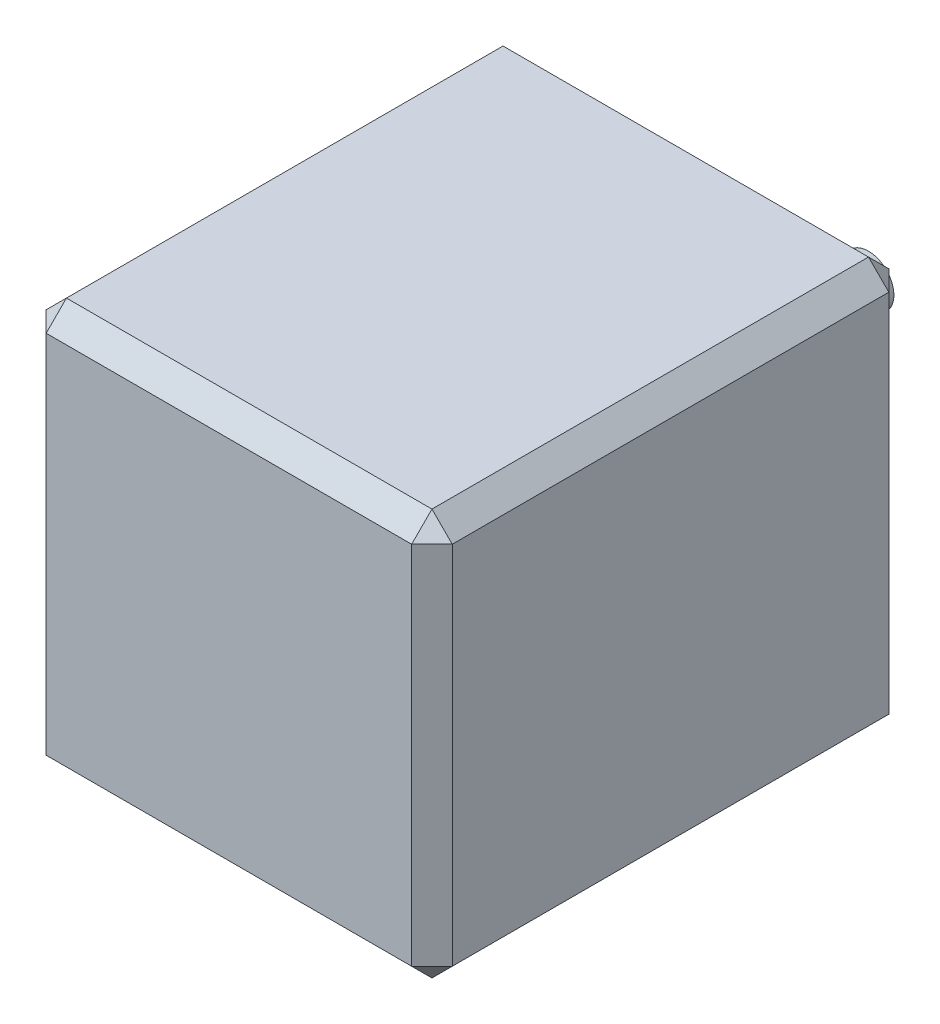
ISO-10303-21;
HEADER;
FILE_DESCRIPTION(('STEP AP214'),'2;1');
FILE_NAME('part.step','',(''),(''),'','','');
FILE_SCHEMA(('AUTOMOTIVE_DESIGN { 1 0 10303 214 1 1 1 1 }'));
ENDSEC;
DATA;
#1=APPLICATION_CONTEXT('core data for automotive mechanical design processes');
#2=APPLICATION_PROTOCOL_DEFINITION('international standard','automotive_design',2000,#1);
#3=PRODUCT_CONTEXT('',#1,'mechanical');
#4=PRODUCT('Part','Part','',(#3));
#5=PRODUCT_RELATED_PRODUCT_CATEGORY('part','',(#4));
#6=PRODUCT_DEFINITION_FORMATION('','',#4);
#7=PRODUCT_DEFINITION_CONTEXT('part definition',#1,'design');
#8=PRODUCT_DEFINITION('design','',#6,#7);
#9=PRODUCT_DEFINITION_SHAPE('','',#8);
#10=(LENGTH_UNIT() NAMED_UNIT(*) SI_UNIT(.MILLI.,.METRE.));
#11=(NAMED_UNIT(*) PLANE_ANGLE_UNIT() SI_UNIT($,.RADIAN.));
#12=(NAMED_UNIT(*) SI_UNIT($,.STERADIAN.) SOLID_ANGLE_UNIT());
#13=UNCERTAINTY_MEASURE_WITH_UNIT(LENGTH_MEASURE(1.E-05),#10,'distance_accuracy_value','');
#14=(GEOMETRIC_REPRESENTATION_CONTEXT(3) GLOBAL_UNCERTAINTY_ASSIGNED_CONTEXT((#13)) GLOBAL_UNIT_ASSIGNED_CONTEXT((#10,
#11,#12)) REPRESENTATION_CONTEXT('',''));
#15=CARTESIAN_POINT('',(0.,0.,0.));
#16=DIRECTION('',(0.,0.,1.));
#17=DIRECTION('',(1.,0.,0.));
#18=AXIS2_PLACEMENT_3D('',#15,#16,#17);
#19=CARTESIAN_POINT('',(20.,20.,23.5));
#20=DIRECTION('',(-1.,0.,0.));
#21=DIRECTION('',(0.,-1.,0.));
#22=AXIS2_PLACEMENT_3D('',#19,#20,#21);
#23=PLANE('',#22);
#24=DIRECTION('',(0.,-1.,0.));
#25=VECTOR('',#24,1.);
#26=CARTESIAN_POINT('',(20.,-20.,21.5));
#27=LINE('',#26,#25);
#28=CARTESIAN_POINT('',(20.,18.,21.5));
#29=VERTEX_POINT('',#28);
#30=CARTESIAN_POINT('',(20.,-18.,21.5));
#31=VERTEX_POINT('',#30);
#32=EDGE_CURVE('E199',#29,#31,#27,.T.);
#33=ORIENTED_EDGE('',*,*,#32,.T.);
#34=DIRECTION('',(0.,0.,-1.));
#35=VECTOR('',#34,1.);
#36=CARTESIAN_POINT('',(20.,-18.,23.5));
#37=LINE('',#36,#35);
#38=CARTESIAN_POINT('',(20.,-18.,-21.5));
#39=VERTEX_POINT('',#38);
#40=EDGE_CURVE('E201',#31,#39,#37,.T.);
#41=ORIENTED_EDGE('',*,*,#40,.T.);
#42=DIRECTION('',(0.,1.,0.));
#43=VECTOR('',#42,1.);
#44=CARTESIAN_POINT('',(20.,20.,-21.5));
#45=LINE('',#44,#43);
#46=CARTESIAN_POINT('',(20.,18.,-21.5));
#47=VERTEX_POINT('',#46);
#48=EDGE_CURVE('E197',#39,#47,#45,.T.);
#49=ORIENTED_EDGE('',*,*,#48,.T.);
#50=DIRECTION('',(0.,0.,1.));
#51=VECTOR('',#50,1.);
#52=CARTESIAN_POINT('',(20.,18.,23.5));
#53=LINE('',#52,#51);
#54=EDGE_CURVE('E195',#47,#29,#53,.T.);
#55=ORIENTED_EDGE('',*,*,#54,.T.);
#56=EDGE_LOOP('',(#33,#41,#49,#55));
#57=FACE_BOUND('',#56,.T.);
#58=ADVANCED_FACE('F39',(#57),#23,.F.);
#59=CARTESIAN_POINT('',(-20.,20.,23.5));
#60=DIRECTION('',(0.,-1.,0.));
#61=DIRECTION('',(0.,0.,-1.));
#62=AXIS2_PLACEMENT_3D('',#59,#60,#61);
#63=PLANE('',#62);
#64=DIRECTION('',(1.,0.,0.));
#65=VECTOR('',#64,1.);
#66=CARTESIAN_POINT('',(20.,20.,21.5));
#67=LINE('',#66,#65);
#68=CARTESIAN_POINT('',(-18.,20.,21.5));
#69=VERTEX_POINT('',#68);
#70=CARTESIAN_POINT('',(18.,20.,21.5));
#71=VERTEX_POINT('',#70);
#72=EDGE_CURVE('E56',#69,#71,#67,.T.);
#73=ORIENTED_EDGE('',*,*,#72,.T.);
#74=DIRECTION('',(0.,0.,-1.));
#75=VECTOR('',#74,1.);
#76=CARTESIAN_POINT('',(18.,20.,23.5));
#77=LINE('',#76,#75);
#78=CARTESIAN_POINT('',(18.,20.,-21.5));
#79=VERTEX_POINT('',#78);
#80=EDGE_CURVE('E49',#71,#79,#77,.T.);
#81=ORIENTED_EDGE('',*,*,#80,.T.);
#82=DIRECTION('',(-1.,0.,0.));
#83=VECTOR('',#82,1.);
#84=CARTESIAN_POINT('',(-20.,20.,-21.5));
#85=LINE('',#84,#83);
#86=CARTESIAN_POINT('',(-18.,20.,-21.5));
#87=VERTEX_POINT('',#86);
#88=EDGE_CURVE('E204',#79,#87,#85,.T.);
#89=ORIENTED_EDGE('',*,*,#88,.T.);
#90=DIRECTION('',(0.,0.,1.));
#91=VECTOR('',#90,1.);
#92=CARTESIAN_POINT('',(-18.,20.,23.5));
#93=LINE('',#92,#91);
#94=EDGE_CURVE('E61',#87,#69,#93,.T.);
#95=ORIENTED_EDGE('',*,*,#94,.T.);
#96=EDGE_LOOP('',(#73,#81,#89,#95));
#97=FACE_BOUND('',#96,.T.);
#98=ADVANCED_FACE('F309',(#97),#63,.F.);
#99=CARTESIAN_POINT('',(-20.,20.,23.5));
#100=DIRECTION('',(1.,0.,0.));
#101=DIRECTION('',(0.,1.,0.));
#102=AXIS2_PLACEMENT_3D('',#99,#100,#101);
#103=PLANE('',#102);
#104=DIRECTION('',(0.,-1.,0.));
#105=VECTOR('',#104,1.);
#106=CARTESIAN_POINT('',(-20.,20.,-21.5));
#107=LINE('',#106,#105);
#108=CARTESIAN_POINT('',(-20.,18.,-21.5));
#109=VERTEX_POINT('',#108);
#110=CARTESIAN_POINT('',(-20.,-18.,-21.5));
#111=VERTEX_POINT('',#110);
#112=EDGE_CURVE('E181',#109,#111,#107,.T.);
#113=ORIENTED_EDGE('',*,*,#112,.T.);
#114=DIRECTION('',(0.,0.,1.));
#115=VECTOR('',#114,1.);
#116=CARTESIAN_POINT('',(-20.,-18.,23.5));
#117=LINE('',#116,#115);
#118=CARTESIAN_POINT('',(-20.,-18.,21.5));
#119=VERTEX_POINT('',#118);
#120=EDGE_CURVE('E183',#111,#119,#117,.T.);
#121=ORIENTED_EDGE('',*,*,#120,.T.);
#122=DIRECTION('',(0.,1.,0.));
#123=VECTOR('',#122,1.);
#124=CARTESIAN_POINT('',(-20.,20.,21.5));
#125=LINE('',#124,#123);
#126=CARTESIAN_POINT('',(-20.,18.,21.5));
#127=VERTEX_POINT('',#126);
#128=EDGE_CURVE('E179',#119,#127,#125,.T.);
#129=ORIENTED_EDGE('',*,*,#128,.T.);
#130=DIRECTION('',(0.,0.,-1.));
#131=VECTOR('',#130,1.);
#132=CARTESIAN_POINT('',(-20.,18.,23.5));
#133=LINE('',#132,#131);
#134=EDGE_CURVE('E177',#127,#109,#133,.T.);
#135=ORIENTED_EDGE('',*,*,#134,.T.);
#136=EDGE_LOOP('',(#113,#121,#129,#135));
#137=FACE_BOUND('',#136,.T.);
#138=ADVANCED_FACE('F278',(#137),#103,.F.);
#139=CARTESIAN_POINT('',(-20.,-20.,23.5));
#140=DIRECTION('',(0.,1.,0.));
#141=DIRECTION('',(0.,0.,1.));
#142=AXIS2_PLACEMENT_3D('',#139,#140,#141);
#143=PLANE('',#142);
#144=DIRECTION('',(0.,0.,-1.));
#145=VECTOR('',#144,1.);
#146=CARTESIAN_POINT('',(-18.,-20.,23.5));
#147=LINE('',#146,#145);
#148=CARTESIAN_POINT('',(-18.,-20.,21.5));
#149=VERTEX_POINT('',#148);
#150=CARTESIAN_POINT('',(-18.,-20.,-21.5));
#151=VERTEX_POINT('',#150);
#152=EDGE_CURVE('E164',#149,#151,#147,.T.);
#153=ORIENTED_EDGE('',*,*,#152,.T.);
#154=DIRECTION('',(1.,0.,0.));
#155=VECTOR('',#154,1.);
#156=CARTESIAN_POINT('',(-20.,-20.,-21.5));
#157=LINE('',#156,#155);
#158=CARTESIAN_POINT('',(18.,-20.,-21.5));
#159=VERTEX_POINT('',#158);
#160=EDGE_CURVE('E134',#151,#159,#157,.T.);
#161=ORIENTED_EDGE('',*,*,#160,.T.);
#162=DIRECTION('',(0.,0.,1.));
#163=VECTOR('',#162,1.);
#164=CARTESIAN_POINT('',(18.,-20.,23.5));
#165=LINE('',#164,#163);
#166=CARTESIAN_POINT('',(18.,-20.,21.5));
#167=VERTEX_POINT('',#166);
#168=EDGE_CURVE('E153',#159,#167,#165,.T.);
#169=ORIENTED_EDGE('',*,*,#168,.T.);
#170=DIRECTION('',(-1.,0.,0.));
#171=VECTOR('',#170,1.);
#172=CARTESIAN_POINT('',(-20.,-20.,21.5));
#173=LINE('',#172,#171);
#174=EDGE_CURVE('E159',#167,#149,#173,.T.);
#175=ORIENTED_EDGE('',*,*,#174,.T.);
#176=EDGE_LOOP('',(#153,#161,#169,#175));
#177=FACE_BOUND('',#176,.T.);
#178=ADVANCED_FACE('F162',(#177),#143,.F.);
#179=CARTESIAN_POINT('',(0.,0.,23.5));
#180=DIRECTION('',(0.,0.,1.));
#181=DIRECTION('',(1.,0.,0.));
#182=AXIS2_PLACEMENT_3D('',#179,#180,#181);
#183=PLANE('',#182);
#184=DIRECTION('',(0.,-1.,0.));
#185=VECTOR('',#184,1.);
#186=CARTESIAN_POINT('',(-18.,-20.,23.5));
#187=LINE('',#186,#185);
#188=CARTESIAN_POINT('',(-18.,18.,23.5));
#189=VERTEX_POINT('',#188);
#190=CARTESIAN_POINT('',(-18.,-18.,23.5));
#191=VERTEX_POINT('',#190);
#192=EDGE_CURVE('E190',#189,#191,#187,.T.);
#193=ORIENTED_EDGE('',*,*,#192,.T.);
#194=DIRECTION('',(1.,0.,0.));
#195=VECTOR('',#194,1.);
#196=CARTESIAN_POINT('',(20.,-18.,23.5));
#197=LINE('',#196,#195);
#198=CARTESIAN_POINT('',(18.,-18.,23.5));
#199=VERTEX_POINT('',#198);
#200=EDGE_CURVE('E192',#191,#199,#197,.T.);
#201=ORIENTED_EDGE('',*,*,#200,.T.);
#202=DIRECTION('',(0.,1.,0.));
#203=VECTOR('',#202,1.);
#204=CARTESIAN_POINT('',(18.,20.,23.5));
#205=LINE('',#204,#203);
#206=CARTESIAN_POINT('',(18.,18.,23.5));
#207=VERTEX_POINT('',#206);
#208=EDGE_CURVE('E188',#199,#207,#205,.T.);
#209=ORIENTED_EDGE('',*,*,#208,.T.);
#210=DIRECTION('',(-1.,0.,0.));
#211=VECTOR('',#210,1.);
#212=CARTESIAN_POINT('',(-20.,18.,23.5));
#213=LINE('',#212,#211);
#214=EDGE_CURVE('E186',#207,#189,#213,.T.);
#215=ORIENTED_EDGE('',*,*,#214,.T.);
#216=EDGE_LOOP('',(#193,#201,#209,#215));
#217=FACE_BOUND('',#216,.T.);
#218=ADVANCED_FACE('F287',(#217),#183,.T.);
#219=CARTESIAN_POINT('',(0.,0.,-23.5));
#220=DIRECTION('',(0.,0.,1.));
#221=DIRECTION('',(1.,0.,0.));
#222=AXIS2_PLACEMENT_3D('',#219,#220,#221);
#223=PLANE('',#222);
#224=CARTESIAN_POINT('',(0.,0.,-23.5));
#225=DIRECTION('',(0.,0.,1.));
#226=DIRECTION('',(1.,0.,0.));
#227=AXIS2_PLACEMENT_3D('',#224,#225,#226);
#228=CIRCLE('',#227,11.);
#229=CARTESIAN_POINT('',(11.,0.,-23.5));
#230=VERTEX_POINT('',#229);
#231=EDGE_CURVE('E11',#230,#230,#228,.F.);
#232=ORIENTED_EDGE('',*,*,#231,.F.);
#233=EDGE_LOOP('',(#232));
#234=FACE_BOUND('',#233,.T.);
#235=DIRECTION('',(0.,-1.,0.));
#236=VECTOR('',#235,1.);
#237=CARTESIAN_POINT('',(18.,0.,-23.5));
#238=LINE('',#237,#236);
#239=CARTESIAN_POINT('',(18.,18.,-23.5));
#240=VERTEX_POINT('',#239);
#241=CARTESIAN_POINT('',(18.,-18.,-23.5));
#242=VERTEX_POINT('',#241);
#243=EDGE_CURVE('E168',#240,#242,#238,.T.);
#244=ORIENTED_EDGE('',*,*,#243,.T.);
#245=DIRECTION('',(-1.,0.,0.));
#246=VECTOR('',#245,1.);
#247=CARTESIAN_POINT('',(0.,-18.,-23.5));
#248=LINE('',#247,#246);
#249=CARTESIAN_POINT('',(-18.,-18.,-23.5));
#250=VERTEX_POINT('',#249);
#251=EDGE_CURVE('E136',#242,#250,#248,.T.);
#252=ORIENTED_EDGE('',*,*,#251,.T.);
#253=DIRECTION('',(0.,1.,0.));
#254=VECTOR('',#253,1.);
#255=CARTESIAN_POINT('',(-18.,0.,-23.5));
#256=LINE('',#255,#254);
#257=CARTESIAN_POINT('',(-18.,18.,-23.5));
#258=VERTEX_POINT('',#257);
#259=EDGE_CURVE('E174',#250,#258,#256,.T.);
#260=ORIENTED_EDGE('',*,*,#259,.T.);
#261=DIRECTION('',(1.,0.,0.));
#262=VECTOR('',#261,1.);
#263=CARTESIAN_POINT('',(0.,18.,-23.5));
#264=LINE('',#263,#262);
#265=EDGE_CURVE('E166',#258,#240,#264,.T.);
#266=ORIENTED_EDGE('',*,*,#265,.T.);
#267=EDGE_LOOP('',(#244,#252,#260,#266));
#268=FACE_BOUND('',#267,.T.);
#269=ADVANCED_FACE('F437',(#234,#268),#223,.F.);
#270=CARTESIAN_POINT('',(0.,18.,23.5));
#271=DIRECTION('',(0.,0.707106781186546,0.707106781186549));
#272=DIRECTION('',(1.,0.,0.));
#273=AXIS2_PLACEMENT_3D('',#270,#271,#272);
#274=PLANE('',#273);
#275=DIRECTION('',(0.,0.707106781186549,-0.707106781186546));
#276=VECTOR('',#275,1.);
#277=CARTESIAN_POINT('',(-18.,19.,22.5));
#278=LINE('',#277,#276);
#279=EDGE_CURVE('E160',#189,#69,#278,.T.);
#280=ORIENTED_EDGE('',*,*,#279,.F.);
#281=ORIENTED_EDGE('',*,*,#214,.F.);
#282=DIRECTION('',(0.,-0.707106781186549,0.707106781186546));
#283=VECTOR('',#282,1.);
#284=CARTESIAN_POINT('',(18.,18.,23.5));
#285=LINE('',#284,#283);
#286=EDGE_CURVE('E259',#71,#207,#285,.T.);
#287=ORIENTED_EDGE('',*,*,#286,.F.);
#288=ORIENTED_EDGE('',*,*,#72,.F.);
#289=EDGE_LOOP('',(#280,#281,#287,#288));
#290=FACE_BOUND('',#289,.T.);
#291=ADVANCED_FACE('F42',(#290),#274,.T.);
#292=CARTESIAN_POINT('',(-20.,18.,21.5));
#293=DIRECTION('',(-0.577350269189628,0.577350269189624,0.577350269189626));
#294=DIRECTION('',(0.707106781186546,0.,0.707106781186549));
#295=AXIS2_PLACEMENT_3D('',#292,#293,#294);
#296=PLANE('',#295);
#297=DIRECTION('',(0.707106781186546,0.,0.707106781186549));
#298=VECTOR('',#297,1.);
#299=CARTESIAN_POINT('',(-20.,18.,21.5));
#300=LINE('',#299,#298);
#301=EDGE_CURVE('E253',#189,#127,#300,.F.);
#302=ORIENTED_EDGE('',*,*,#301,.F.);
#303=ORIENTED_EDGE('',*,*,#279,.T.);
#304=DIRECTION('',(0.707106781186546,0.707106781186549,0.));
#305=VECTOR('',#304,1.);
#306=CARTESIAN_POINT('',(-20.,18.,21.5));
#307=LINE('',#306,#305);
#308=EDGE_CURVE('E256',#127,#69,#307,.T.);
#309=ORIENTED_EDGE('',*,*,#308,.F.);
#310=EDGE_LOOP('',(#302,#303,#309));
#311=FACE_BOUND('',#310,.T.);
#312=ADVANCED_FACE('F267',(#311),#296,.T.);
#313=CARTESIAN_POINT('',(18.,18.,23.5));
#314=DIRECTION('',(0.577350269189628,0.577350269189624,0.577350269189626));
#315=DIRECTION('',(0.707106781186546,0.,-0.707106781186549));
#316=AXIS2_PLACEMENT_3D('',#313,#314,#315);
#317=PLANE('',#316);
#318=DIRECTION('',(0.707106781186546,-0.707106781186549,0.));
#319=VECTOR('',#318,1.);
#320=CARTESIAN_POINT('',(19.,19.,21.5));
#321=LINE('',#320,#319);
#322=EDGE_CURVE('E247',#71,#29,#321,.T.);
#323=ORIENTED_EDGE('',*,*,#322,.F.);
#324=ORIENTED_EDGE('',*,*,#286,.T.);
#325=DIRECTION('',(0.707106781186546,0.,-0.707106781186548));
#326=VECTOR('',#325,1.);
#327=CARTESIAN_POINT('',(18.,18.,23.5));
#328=LINE('',#327,#326);
#329=EDGE_CURVE('E250',#29,#207,#328,.F.);
#330=ORIENTED_EDGE('',*,*,#329,.F.);
#331=EDGE_LOOP('',(#323,#324,#330));
#332=FACE_BOUND('',#331,.T.);
#333=ADVANCED_FACE('F302',(#332),#317,.T.);
#334=CARTESIAN_POINT('',(-20.,18.,23.5));
#335=DIRECTION('',(0.707106781186549,-0.707106781186546,0.));
#336=DIRECTION('',(0.,0.,-1.));
#337=AXIS2_PLACEMENT_3D('',#334,#335,#336);
#338=PLANE('',#337);
#339=ORIENTED_EDGE('',*,*,#308,.T.);
#340=ORIENTED_EDGE('',*,*,#94,.F.);
#341=DIRECTION('',(-0.707106781186546,-0.707106781186549,0.));
#342=VECTOR('',#341,1.);
#343=CARTESIAN_POINT('',(-19.,19.,-21.5));
#344=LINE('',#343,#342);
#345=EDGE_CURVE('E241',#109,#87,#344,.F.);
#346=ORIENTED_EDGE('',*,*,#345,.F.);
#347=ORIENTED_EDGE('',*,*,#134,.F.);
#348=EDGE_LOOP('',(#339,#340,#346,#347));
#349=FACE_BOUND('',#348,.T.);
#350=ADVANCED_FACE('F273',(#349),#338,.F.);
#351=CARTESIAN_POINT('',(-18.,0.,23.5));
#352=DIRECTION('',(-0.707106781186549,0.,0.707106781186546));
#353=DIRECTION('',(0.,1.,0.));
#354=AXIS2_PLACEMENT_3D('',#351,#352,#353);
#355=PLANE('',#354);
#356=ORIENTED_EDGE('',*,*,#301,.T.);
#357=ORIENTED_EDGE('',*,*,#128,.F.);
#358=DIRECTION('',(-0.707106781186546,0.,-0.707106781186549));
#359=VECTOR('',#358,1.);
#360=CARTESIAN_POINT('',(-20.,-18.,21.5));
#361=LINE('',#360,#359);
#362=EDGE_CURVE('E238',#191,#119,#361,.T.);
#363=ORIENTED_EDGE('',*,*,#362,.F.);
#364=ORIENTED_EDGE('',*,*,#192,.F.);
#365=EDGE_LOOP('',(#356,#357,#363,#364));
#366=FACE_BOUND('',#365,.T.);
#367=ADVANCED_FACE('F284',(#366),#355,.T.);
#368=CARTESIAN_POINT('',(0.,-18.,23.5));
#369=DIRECTION('',(0.,-0.707106781186549,0.707106781186546));
#370=DIRECTION('',(-1.,0.,0.));
#371=AXIS2_PLACEMENT_3D('',#368,#369,#370);
#372=PLANE('',#371);
#373=DIRECTION('',(0.,-0.707106781186546,-0.707106781186549));
#374=VECTOR('',#373,1.);
#375=CARTESIAN_POINT('',(18.,-18.,23.5));
#376=LINE('',#375,#374);
#377=EDGE_CURVE('E232',#199,#167,#376,.T.);
#378=ORIENTED_EDGE('',*,*,#377,.F.);
#379=ORIENTED_EDGE('',*,*,#200,.F.);
#380=DIRECTION('',(0.,0.707106781186546,0.707106781186549));
#381=VECTOR('',#380,1.);
#382=CARTESIAN_POINT('',(-18.,-19.,22.5));
#383=LINE('',#382,#381);
#384=EDGE_CURVE('E235',#149,#191,#383,.T.);
#385=ORIENTED_EDGE('',*,*,#384,.F.);
#386=ORIENTED_EDGE('',*,*,#174,.F.);
#387=EDGE_LOOP('',(#378,#379,#385,#386));
#388=FACE_BOUND('',#387,.T.);
#389=ADVANCED_FACE('F291',(#388),#372,.T.);
#390=CARTESIAN_POINT('',(18.,0.,23.5));
#391=DIRECTION('',(0.707106781186548,0.,0.707106781186547));
#392=DIRECTION('',(0.,-1.,0.));
#393=AXIS2_PLACEMENT_3D('',#390,#391,#392);
#394=PLANE('',#393);
#395=ORIENTED_EDGE('',*,*,#329,.T.);
#396=ORIENTED_EDGE('',*,*,#208,.F.);
#397=DIRECTION('',(-0.707106781186547,0.,0.707106781186548));
#398=VECTOR('',#397,1.);
#399=CARTESIAN_POINT('',(18.,-18.,23.5));
#400=LINE('',#399,#398);
#401=EDGE_CURVE('E230',#31,#199,#400,.T.);
#402=ORIENTED_EDGE('',*,*,#401,.F.);
#403=ORIENTED_EDGE('',*,*,#32,.F.);
#404=EDGE_LOOP('',(#395,#396,#402,#403));
#405=FACE_BOUND('',#404,.T.);
#406=ADVANCED_FACE('F297',(#405),#394,.T.);
#407=CARTESIAN_POINT('',(18.,20.,23.5));
#408=DIRECTION('',(-0.707106781186549,-0.707106781186546,0.));
#409=DIRECTION('',(0.,0.,-1.));
#410=AXIS2_PLACEMENT_3D('',#407,#408,#409);
#411=PLANE('',#410);
#412=ORIENTED_EDGE('',*,*,#322,.T.);
#413=ORIENTED_EDGE('',*,*,#54,.F.);
#414=DIRECTION('',(-0.707106781186546,0.707106781186549,0.));
#415=VECTOR('',#414,1.);
#416=CARTESIAN_POINT('',(20.,18.,-21.5));
#417=LINE('',#416,#415);
#418=EDGE_CURVE('E227',#79,#47,#417,.F.);
#419=ORIENTED_EDGE('',*,*,#418,.F.);
#420=ORIENTED_EDGE('',*,*,#80,.F.);
#421=EDGE_LOOP('',(#412,#413,#419,#420));
#422=FACE_BOUND('',#421,.T.);
#423=ADVANCED_FACE('F307',(#422),#411,.F.);
#424=CARTESIAN_POINT('',(-20.,20.,-21.5));
#425=DIRECTION('',(0.,-0.707106781186546,0.707106781186549));
#426=DIRECTION('',(-1.,0.,0.));
#427=AXIS2_PLACEMENT_3D('',#424,#425,#426);
#428=PLANE('',#427);
#429=DIRECTION('',(0.,0.707106781186549,0.707106781186546));
#430=VECTOR('',#429,1.);
#431=CARTESIAN_POINT('',(-18.,18.,-23.5));
#432=LINE('',#431,#430);
#433=EDGE_CURVE('E244',#87,#258,#432,.F.);
#434=ORIENTED_EDGE('',*,*,#433,.F.);
#435=ORIENTED_EDGE('',*,*,#88,.F.);
#436=DIRECTION('',(0.,-0.707106781186549,-0.707106781186546));
#437=VECTOR('',#436,1.);
#438=CARTESIAN_POINT('',(18.,19.,-22.5));
#439=LINE('',#438,#437);
#440=EDGE_CURVE('E225',#240,#79,#439,.F.);
#441=ORIENTED_EDGE('',*,*,#440,.F.);
#442=ORIENTED_EDGE('',*,*,#265,.F.);
#443=EDGE_LOOP('',(#434,#435,#441,#442));
#444=FACE_BOUND('',#443,.T.);
#445=ADVANCED_FACE('F312',(#444),#428,.F.);
#446=CARTESIAN_POINT('',(-18.,18.,-23.5));
#447=DIRECTION('',(-0.577350269189626,0.577350269189624,-0.577350269189628));
#448=DIRECTION('',(-0.707106781186549,0.,0.707106781186546));
#449=AXIS2_PLACEMENT_3D('',#446,#447,#448);
#450=PLANE('',#449);
#451=ORIENTED_EDGE('',*,*,#345,.T.);
#452=ORIENTED_EDGE('',*,*,#433,.T.);
#453=DIRECTION('',(0.707106781186549,0.,-0.707106781186546));
#454=VECTOR('',#453,1.);
#455=CARTESIAN_POINT('',(-18.,18.,-23.5));
#456=LINE('',#455,#454);
#457=EDGE_CURVE('E222',#109,#258,#456,.T.);
#458=ORIENTED_EDGE('',*,*,#457,.F.);
#459=EDGE_LOOP('',(#451,#452,#458));
#460=FACE_BOUND('',#459,.T.);
#461=ADVANCED_FACE('F316',(#460),#450,.T.);
#462=CARTESIAN_POINT('',(-20.,-18.,21.5));
#463=DIRECTION('',(-0.577350269189628,-0.577350269189626,0.577350269189624));
#464=DIRECTION('',(0.707106781186546,-0.707106781186549,0.));
#465=AXIS2_PLACEMENT_3D('',#462,#463,#464);
#466=PLANE('',#465);
#467=ORIENTED_EDGE('',*,*,#384,.T.);
#468=ORIENTED_EDGE('',*,*,#362,.T.);
#469=DIRECTION('',(-0.707106781186546,0.707106781186549,0.));
#470=VECTOR('',#469,1.);
#471=CARTESIAN_POINT('',(-20.,-18.,21.5));
#472=LINE('',#471,#470);
#473=EDGE_CURVE('E220',#149,#119,#472,.T.);
#474=ORIENTED_EDGE('',*,*,#473,.F.);
#475=EDGE_LOOP('',(#467,#468,#474));
#476=FACE_BOUND('',#475,.T.);
#477=ADVANCED_FACE('F327',(#476),#466,.T.);
#478=CARTESIAN_POINT('',(18.,-18.,23.5));
#479=DIRECTION('',(0.577350269189625,-0.577350269189628,0.577350269189623));
#480=DIRECTION('',(0.707106781186549,0.707106781186546,0.));
#481=AXIS2_PLACEMENT_3D('',#478,#479,#480);
#482=PLANE('',#481);
#483=ORIENTED_EDGE('',*,*,#401,.T.);
#484=ORIENTED_EDGE('',*,*,#377,.T.);
#485=DIRECTION('',(-0.707106781186549,-0.707106781186546,0.));
#486=VECTOR('',#485,1.);
#487=CARTESIAN_POINT('',(19.,-19.,21.5));
#488=LINE('',#487,#486);
#489=EDGE_CURVE('E156',#31,#167,#488,.T.);
#490=ORIENTED_EDGE('',*,*,#489,.F.);
#491=EDGE_LOOP('',(#483,#484,#490));
#492=FACE_BOUND('',#491,.T.);
#493=ADVANCED_FACE('F329',(#492),#482,.T.);
#494=CARTESIAN_POINT('',(20.,18.,-21.5));
#495=DIRECTION('',(0.577350269189625,0.577350269189623,-0.577350269189628));
#496=DIRECTION('',(-0.707106781186549,0.,-0.707106781186546));
#497=AXIS2_PLACEMENT_3D('',#494,#495,#496);
#498=PLANE('',#497);
#499=ORIENTED_EDGE('',*,*,#440,.T.);
#500=ORIENTED_EDGE('',*,*,#418,.T.);
#501=DIRECTION('',(0.707106781186549,0.,0.707106781186546));
#502=VECTOR('',#501,1.);
#503=CARTESIAN_POINT('',(20.,18.,-21.5));
#504=LINE('',#503,#502);
#505=EDGE_CURVE('E216',#240,#47,#504,.T.);
#506=ORIENTED_EDGE('',*,*,#505,.F.);
#507=EDGE_LOOP('',(#499,#500,#506));
#508=FACE_BOUND('',#507,.T.);
#509=ADVANCED_FACE('F335',(#508),#498,.T.);
#510=CARTESIAN_POINT('',(-20.,20.,-21.5));
#511=DIRECTION('',(0.707106781186546,0.,0.707106781186549));
#512=DIRECTION('',(0.,-1.,0.));
#513=AXIS2_PLACEMENT_3D('',#510,#511,#512);
#514=PLANE('',#513);
#515=ORIENTED_EDGE('',*,*,#457,.T.);
#516=ORIENTED_EDGE('',*,*,#259,.F.);
#517=DIRECTION('',(-0.707106781186549,0.,0.707106781186546));
#518=VECTOR('',#517,1.);
#519=CARTESIAN_POINT('',(-18.,-18.,-23.5));
#520=LINE('',#519,#518);
#521=EDGE_CURVE('E213',#111,#250,#520,.F.);
#522=ORIENTED_EDGE('',*,*,#521,.F.);
#523=ORIENTED_EDGE('',*,*,#112,.F.);
#524=EDGE_LOOP('',(#515,#516,#522,#523));
#525=FACE_BOUND('',#524,.T.);
#526=ADVANCED_FACE('F320',(#525),#514,.F.);
#527=CARTESIAN_POINT('',(-18.,-20.,23.5));
#528=DIRECTION('',(0.707106781186549,0.707106781186546,0.));
#529=DIRECTION('',(0.,0.,-1.));
#530=AXIS2_PLACEMENT_3D('',#527,#528,#529);
#531=PLANE('',#530);
#532=ORIENTED_EDGE('',*,*,#473,.T.);
#533=ORIENTED_EDGE('',*,*,#120,.F.);
#534=DIRECTION('',(0.707106781186546,-0.707106781186549,0.));
#535=VECTOR('',#534,1.);
#536=CARTESIAN_POINT('',(-19.,-19.,-21.5));
#537=LINE('',#536,#535);
#538=EDGE_CURVE('E150',#151,#111,#537,.F.);
#539=ORIENTED_EDGE('',*,*,#538,.F.);
#540=ORIENTED_EDGE('',*,*,#152,.F.);
#541=EDGE_LOOP('',(#532,#533,#539,#540));
#542=FACE_BOUND('',#541,.T.);
#543=ADVANCED_FACE('F325',(#542),#531,.F.);
#544=CARTESIAN_POINT('',(20.,-18.,23.5));
#545=DIRECTION('',(-0.707106781186546,0.707106781186549,0.));
#546=DIRECTION('',(0.,0.,-1.));
#547=AXIS2_PLACEMENT_3D('',#544,#545,#546);
#548=PLANE('',#547);
#549=ORIENTED_EDGE('',*,*,#489,.T.);
#550=ORIENTED_EDGE('',*,*,#168,.F.);
#551=DIRECTION('',(0.707106781186549,0.707106781186546,0.));
#552=VECTOR('',#551,1.);
#553=CARTESIAN_POINT('',(18.,-20.,-21.5));
#554=LINE('',#553,#552);
#555=EDGE_CURVE('E142',#39,#159,#554,.F.);
#556=ORIENTED_EDGE('',*,*,#555,.F.);
#557=ORIENTED_EDGE('',*,*,#40,.F.);
#558=EDGE_LOOP('',(#549,#550,#556,#557));
#559=FACE_BOUND('',#558,.T.);
#560=ADVANCED_FACE('F154',(#559),#548,.F.);
#561=CARTESIAN_POINT('',(20.,20.,-21.5));
#562=DIRECTION('',(-0.707106781186546,0.,0.707106781186549));
#563=DIRECTION('',(0.,1.,0.));
#564=AXIS2_PLACEMENT_3D('',#561,#562,#563);
#565=PLANE('',#564);
#566=ORIENTED_EDGE('',*,*,#505,.T.);
#567=ORIENTED_EDGE('',*,*,#48,.F.);
#568=DIRECTION('',(-0.707106781186549,0.,-0.707106781186546));
#569=VECTOR('',#568,1.);
#570=CARTESIAN_POINT('',(19.,-18.,-22.5));
#571=LINE('',#570,#569);
#572=EDGE_CURVE('E146',#242,#39,#571,.F.);
#573=ORIENTED_EDGE('',*,*,#572,.F.);
#574=ORIENTED_EDGE('',*,*,#243,.F.);
#575=EDGE_LOOP('',(#566,#567,#573,#574));
#576=FACE_BOUND('',#575,.T.);
#577=ADVANCED_FACE('F365',(#576),#565,.F.);
#578=CARTESIAN_POINT('',(-18.,-18.,-23.5));
#579=DIRECTION('',(-0.577350269189626,-0.577350269189624,-0.577350269189628));
#580=DIRECTION('',(-0.707106781186549,0.,0.707106781186546));
#581=AXIS2_PLACEMENT_3D('',#578,#579,#580);
#582=PLANE('',#581);
#583=ORIENTED_EDGE('',*,*,#538,.T.);
#584=ORIENTED_EDGE('',*,*,#521,.T.);
#585=DIRECTION('',(0.,0.707106781186549,-0.707106781186546));
#586=VECTOR('',#585,1.);
#587=CARTESIAN_POINT('',(-18.,-18.,-23.5));
#588=LINE('',#587,#586);
#589=EDGE_CURVE('E138',#151,#250,#588,.T.);
#590=ORIENTED_EDGE('',*,*,#589,.F.);
#591=EDGE_LOOP('',(#583,#584,#590));
#592=FACE_BOUND('',#591,.T.);
#593=ADVANCED_FACE('F323',(#592),#582,.T.);
#594=CARTESIAN_POINT('',(18.,-20.,-21.5));
#595=DIRECTION('',(0.577350269189623,-0.577350269189626,-0.577350269189628));
#596=DIRECTION('',(0.,0.707106781186549,-0.707106781186546));
#597=AXIS2_PLACEMENT_3D('',#594,#595,#596);
#598=PLANE('',#597);
#599=ORIENTED_EDGE('',*,*,#572,.T.);
#600=ORIENTED_EDGE('',*,*,#555,.T.);
#601=DIRECTION('',(0.,-0.707106781186549,0.707106781186546));
#602=VECTOR('',#601,1.);
#603=CARTESIAN_POINT('',(18.,-20.,-21.5));
#604=LINE('',#603,#602);
#605=EDGE_CURVE('E130',#242,#159,#604,.T.);
#606=ORIENTED_EDGE('',*,*,#605,.F.);
#607=EDGE_LOOP('',(#599,#600,#606));
#608=FACE_BOUND('',#607,.T.);
#609=ADVANCED_FACE('F144',(#608),#598,.T.);
#610=CARTESIAN_POINT('',(-20.,-20.,-21.5));
#611=DIRECTION('',(0.,0.707106781186546,0.707106781186549));
#612=DIRECTION('',(1.,0.,0.));
#613=AXIS2_PLACEMENT_3D('',#610,#611,#612);
#614=PLANE('',#613);
#615=ORIENTED_EDGE('',*,*,#589,.T.);
#616=ORIENTED_EDGE('',*,*,#251,.F.);
#617=ORIENTED_EDGE('',*,*,#605,.T.);
#618=ORIENTED_EDGE('',*,*,#160,.F.);
#619=EDGE_LOOP('',(#615,#616,#617,#618));
#620=FACE_BOUND('',#619,.T.);
#621=ADVANCED_FACE('F132',(#620),#614,.F.);
#622=CARTESIAN_POINT('',(0.,0.,-24.5));
#623=DIRECTION('',(0.,0.,1.));
#624=DIRECTION('',(1.,0.,0.));
#625=AXIS2_PLACEMENT_3D('',#622,#623,#624);
#626=CYLINDRICAL_SURFACE('',#625,11.);
#627=CARTESIAN_POINT('',(0.,0.,-24.5));
#628=DIRECTION('',(0.,0.,-1.));
#629=DIRECTION('',(-1.,0.,0.));
#630=AXIS2_PLACEMENT_3D('',#627,#628,#629);
#631=CIRCLE('',#630,11.);
#632=CARTESIAN_POINT('',(-11.,0.,-24.5));
#633=VERTEX_POINT('',#632);
#634=EDGE_CURVE('E139',#633,#633,#631,.T.);
#635=ORIENTED_EDGE('',*,*,#634,.F.);
#636=EDGE_LOOP('',(#635));
#637=FACE_BOUND('',#636,.T.);
#638=ORIENTED_EDGE('',*,*,#231,.T.);
#639=EDGE_LOOP('',(#638));
#640=FACE_BOUND('',#639,.T.);
#641=ADVANCED_FACE('F354',(#637,#640),#626,.T.);
#642=CARTESIAN_POINT('',(0.,0.,-24.5));
#643=DIRECTION('',(0.,0.,-1.));
#644=DIRECTION('',(-1.,0.,0.));
#645=AXIS2_PLACEMENT_3D('',#642,#643,#644);
#646=PLANE('',#645);
#647=CARTESIAN_POINT('',(0.,0.,-24.5));
#648=DIRECTION('',(0.,0.,-1.));
#649=DIRECTION('',(-1.,0.,0.));
#650=AXIS2_PLACEMENT_3D('',#647,#648,#649);
#651=CIRCLE('',#650,2.5);
#652=CARTESIAN_POINT('',(-2.5,0.,-24.5));
#653=VERTEX_POINT('',#652);
#654=EDGE_CURVE('E44',#653,#653,#651,.F.);
#655=ORIENTED_EDGE('',*,*,#654,.T.);
#656=EDGE_LOOP('',(#655));
#657=FACE_BOUND('',#656,.T.);
#658=ORIENTED_EDGE('',*,*,#634,.T.);
#659=EDGE_LOOP('',(#658));
#660=FACE_BOUND('',#659,.T.);
#661=ADVANCED_FACE('F620',(#657,#660),#646,.T.);
#662=CARTESIAN_POINT('',(0.,0.,-39.5));
#663=DIRECTION('',(0.,0.,1.));
#664=DIRECTION('',(1.,0.,0.));
#665=AXIS2_PLACEMENT_3D('',#662,#663,#664);
#666=CYLINDRICAL_SURFACE('',#665,2.5);
#667=ORIENTED_EDGE('',*,*,#654,.F.);
#668=EDGE_LOOP('',(#667));
#669=FACE_BOUND('',#668,.T.);
#670=CARTESIAN_POINT('',(0.,0.,-39.5));
#671=DIRECTION('',(0.,0.,-1.));
#672=DIRECTION('',(-1.,0.,0.));
#673=AXIS2_PLACEMENT_3D('',#670,#671,#672);
#674=CIRCLE('',#673,2.5);
#675=CARTESIAN_POINT('',(-2.5,0.,-39.5));
#676=VERTEX_POINT('',#675);
#677=EDGE_CURVE('E705',#676,#676,#674,.T.);
#678=ORIENTED_EDGE('',*,*,#677,.F.);
#679=EDGE_LOOP('',(#678));
#680=FACE_BOUND('',#679,.T.);
#681=ADVANCED_FACE('F630',(#669,#680),#666,.T.);
#682=CARTESIAN_POINT('',(0.,0.,-39.5));
#683=DIRECTION('',(0.,0.,-1.));
#684=DIRECTION('',(-1.,0.,0.));
#685=AXIS2_PLACEMENT_3D('',#682,#683,#684);
#686=PLANE('',#685);
#687=ORIENTED_EDGE('',*,*,#677,.T.);
#688=EDGE_LOOP('',(#687));
#689=FACE_BOUND('',#688,.T.);
#690=ADVANCED_FACE('F641',(#689),#686,.T.);
#691=CLOSED_SHELL('',(#58,#98,#138,#178,#218,#269,#291,#312,#333,#350,#367,#389,#406,#423,#445,
#461,#477,#493,#509,#526,#543,#560,#577,#593,#609,#621,#641,#661,#681,#690));
#692=MANIFOLD_SOLID_BREP('B2',#691);
#693=ADVANCED_BREP_SHAPE_REPRESENTATION('',(#18,#692),#14);
#694=SHAPE_DEFINITION_REPRESENTATION(#9,#693);
ENDSEC;
END-ISO-10303-21;
